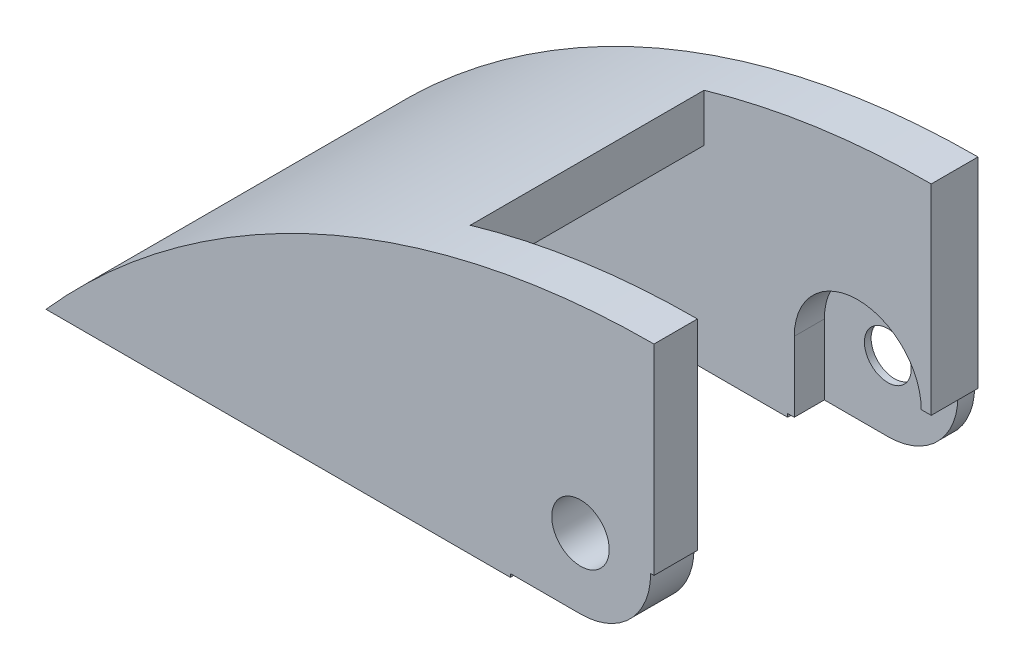
ISO-10303-21;
HEADER;
FILE_DESCRIPTION(('STEP AP214'),'2;1');
FILE_NAME('part.step','',(''),(''),'','','');
FILE_SCHEMA(('AUTOMOTIVE_DESIGN { 1 0 10303 214 1 1 1 1 }'));
ENDSEC;
DATA;
#1=APPLICATION_CONTEXT('core data for automotive mechanical design processes');
#2=APPLICATION_PROTOCOL_DEFINITION('international standard','automotive_design',2000,#1);
#3=PRODUCT_CONTEXT('',#1,'mechanical');
#4=PRODUCT('Part','Part','',(#3));
#5=PRODUCT_RELATED_PRODUCT_CATEGORY('part','',(#4));
#6=PRODUCT_DEFINITION_FORMATION('','',#4);
#7=PRODUCT_DEFINITION_CONTEXT('part definition',#1,'design');
#8=PRODUCT_DEFINITION('design','',#6,#7);
#9=PRODUCT_DEFINITION_SHAPE('','',#8);
#10=(LENGTH_UNIT() NAMED_UNIT(*) SI_UNIT(.MILLI.,.METRE.));
#11=(NAMED_UNIT(*) PLANE_ANGLE_UNIT() SI_UNIT($,.RADIAN.));
#12=(NAMED_UNIT(*) SI_UNIT($,.STERADIAN.) SOLID_ANGLE_UNIT());
#13=UNCERTAINTY_MEASURE_WITH_UNIT(LENGTH_MEASURE(1.E-05),#10,'distance_accuracy_value','');
#14=(GEOMETRIC_REPRESENTATION_CONTEXT(3) GLOBAL_UNCERTAINTY_ASSIGNED_CONTEXT((#13)) GLOBAL_UNIT_ASSIGNED_CONTEXT((#10,
#11,#12)) REPRESENTATION_CONTEXT('',''));
#15=CARTESIAN_POINT('',(0.,0.,0.));
#16=DIRECTION('',(0.,0.,1.));
#17=DIRECTION('',(1.,0.,0.));
#18=AXIS2_PLACEMENT_3D('',#15,#16,#17);
#19=CARTESIAN_POINT('',(0.,0.,-97.));
#20=DIRECTION('',(0.,0.,-1.));
#21=DIRECTION('',(1.,0.,0.));
#22=AXIS2_PLACEMENT_3D('',#19,#20,#21);
#23=PLANE('',#22);
#24=DIRECTION('',(-1.,0.,0.));
#25=VECTOR('',#24,1.);
#26=CARTESIAN_POINT('',(0.,0.,-97.));
#27=LINE('',#26,#25);
#28=CARTESIAN_POINT('',(11.,0.,-97.));
#29=VERTEX_POINT('',#28);
#30=CARTESIAN_POINT('',(10.5,0.,-97.));
#31=VERTEX_POINT('',#30);
#32=EDGE_CURVE('E301',#29,#31,#27,.T.);
#33=ORIENTED_EDGE('',*,*,#32,.T.);
#34=CARTESIAN_POINT('',(0.,0.,-97.));
#35=DIRECTION('',(0.,0.,1.));
#36=DIRECTION('',(1.,0.,0.));
#37=AXIS2_PLACEMENT_3D('',#34,#35,#36);
#38=CIRCLE('',#37,10.5);
#39=CARTESIAN_POINT('',(0.,-10.5,-97.));
#40=VERTEX_POINT('',#39);
#41=EDGE_CURVE('E314',#40,#31,#38,.T.);
#42=ORIENTED_EDGE('',*,*,#41,.F.);
#43=DIRECTION('',(-1.,0.,0.));
#44=VECTOR('',#43,1.);
#45=CARTESIAN_POINT('',(0.,-10.5,-97.));
#46=LINE('',#45,#44);
#47=CARTESIAN_POINT('',(-10.5,-10.5,-97.));
#48=VERTEX_POINT('',#47);
#49=EDGE_CURVE('E318',#40,#48,#46,.T.);
#50=ORIENTED_EDGE('',*,*,#49,.T.);
#51=DIRECTION('',(0.,-1.,0.));
#52=VECTOR('',#51,1.);
#53=CARTESIAN_POINT('',(-10.5,0.,-97.));
#54=LINE('',#53,#52);
#55=CARTESIAN_POINT('',(-10.5,-11.,-97.));
#56=VERTEX_POINT('',#55);
#57=EDGE_CURVE('E322',#48,#56,#54,.T.);
#58=ORIENTED_EDGE('',*,*,#57,.T.);
#59=DIRECTION('',(-1.,0.,0.));
#60=VECTOR('',#59,1.);
#61=CARTESIAN_POINT('',(0.,-11.,-97.));
#62=LINE('',#61,#60);
#63=CARTESIAN_POINT('',(-80.,-11.,-97.));
#64=VERTEX_POINT('',#63);
#65=EDGE_CURVE('E408',#56,#64,#62,.T.);
#66=ORIENTED_EDGE('',*,*,#65,.T.);
#67=CARTESIAN_POINT('',(11.,-91.4878048780488,-97.));
#68=DIRECTION('',(0.,0.,1.));
#69=DIRECTION('',(1.,0.,0.));
#70=AXIS2_PLACEMENT_3D('',#67,#68,#69);
#71=CIRCLE('',#70,121.487804878049);
#72=CARTESIAN_POINT('',(11.,30.,-97.));
#73=VERTEX_POINT('',#72);
#74=EDGE_CURVE('E402',#64,#73,#71,.F.);
#75=ORIENTED_EDGE('',*,*,#74,.T.);
#76=DIRECTION('',(0.,-1.,0.));
#77=VECTOR('',#76,1.);
#78=CARTESIAN_POINT('',(11.,0.,-97.));
#79=LINE('',#78,#77);
#80=EDGE_CURVE('E421',#73,#29,#79,.T.);
#81=ORIENTED_EDGE('',*,*,#80,.T.);
#82=EDGE_LOOP('',(#33,#42,#50,#58,#66,#75,#81));
#83=FACE_BOUND('',#82,.T.);
#84=CARTESIAN_POINT('',(0.,0.,-97.));
#85=DIRECTION('',(0.,0.,1.));
#86=DIRECTION('',(1.,0.,0.));
#87=AXIS2_PLACEMENT_3D('',#84,#85,#86);
#88=CIRCLE('',#87,6.);
#89=CARTESIAN_POINT('',(0.,-6.,-97.));
#90=VERTEX_POINT('',#89);
#91=CARTESIAN_POINT('',(0.,6.,-97.));
#92=VERTEX_POINT('',#91);
#93=EDGE_CURVE('E228',#90,#92,#88,.T.);
#94=ORIENTED_EDGE('',*,*,#93,.T.);
#95=DIRECTION('',(-1.,0.,0.));
#96=VECTOR('',#95,1.);
#97=CARTESIAN_POINT('',(0.,6.,-97.));
#98=LINE('',#97,#96);
#99=CARTESIAN_POINT('',(-25.,6.,-97.));
#100=VERTEX_POINT('',#99);
#101=EDGE_CURVE('E252',#92,#100,#98,.T.);
#102=ORIENTED_EDGE('',*,*,#101,.T.);
#103=DIRECTION('',(0.,-1.,0.));
#104=VECTOR('',#103,1.);
#105=CARTESIAN_POINT('',(-25.,0.,-97.));
#106=LINE('',#105,#104);
#107=CARTESIAN_POINT('',(-25.,-6.,-97.));
#108=VERTEX_POINT('',#107);
#109=EDGE_CURVE('E240',#100,#108,#106,.T.);
#110=ORIENTED_EDGE('',*,*,#109,.T.);
#111=DIRECTION('',(-1.,0.,0.));
#112=VECTOR('',#111,1.);
#113=CARTESIAN_POINT('',(0.,-6.,-97.));
#114=LINE('',#113,#112);
#115=EDGE_CURVE('E247',#90,#108,#114,.T.);
#116=ORIENTED_EDGE('',*,*,#115,.F.);
#117=EDGE_LOOP('',(#94,#102,#110,#116));
#118=FACE_BOUND('',#117,.T.);
#119=ADVANCED_FACE('F49',(#83,#118),#23,.T.);
#120=CARTESIAN_POINT('',(0.,0.,-75.3));
#121=DIRECTION('',(0.,0.,-1.));
#122=DIRECTION('',(1.,0.,0.));
#123=AXIS2_PLACEMENT_3D('',#120,#121,#122);
#124=CYLINDRICAL_SURFACE('',#123,3.5);
#125=CARTESIAN_POINT('',(0.,0.,-94.5));
#126=DIRECTION('',(0.,0.,-1.));
#127=DIRECTION('',(0.,1.,0.));
#128=AXIS2_PLACEMENT_3D('',#125,#126,#127);
#129=CIRCLE('',#128,3.5);
#130=CARTESIAN_POINT('',(0.,3.5,-94.5));
#131=VERTEX_POINT('',#130);
#132=EDGE_CURVE('E53',#131,#131,#129,.T.);
#133=ORIENTED_EDGE('',*,*,#132,.F.);
#134=EDGE_LOOP('',(#133));
#135=FACE_BOUND('',#134,.T.);
#136=CARTESIAN_POINT('',(0.,0.,-95.5));
#137=DIRECTION('',(0.,0.,1.));
#138=DIRECTION('',(1.,0.,0.));
#139=AXIS2_PLACEMENT_3D('',#136,#137,#138);
#140=CIRCLE('',#139,3.5);
#141=CARTESIAN_POINT('',(3.5,0.,-95.5));
#142=VERTEX_POINT('',#141);
#143=EDGE_CURVE('E236',#142,#142,#140,.F.);
#144=ORIENTED_EDGE('',*,*,#143,.T.);
#145=EDGE_LOOP('',(#144));
#146=FACE_BOUND('',#145,.T.);
#147=ADVANCED_FACE('F577',(#135,#146),#124,.F.);
#148=CARTESIAN_POINT('',(12.,-12.,-90.));
#149=DIRECTION('',(0.,0.,-1.));
#150=DIRECTION('',(0.,-1.,0.));
#151=AXIS2_PLACEMENT_3D('',#148,#149,#150);
#152=PLANE('',#151);
#153=DIRECTION('',(-1.,0.,0.));
#154=VECTOR('',#153,1.);
#155=CARTESIAN_POINT('',(12.,0.,-90.));
#156=LINE('',#155,#154);
#157=CARTESIAN_POINT('',(11.,0.,-90.));
#158=VERTEX_POINT('',#157);
#159=CARTESIAN_POINT('',(9.5,0.,-90.));
#160=VERTEX_POINT('',#159);
#161=EDGE_CURVE('E353',#158,#160,#156,.T.);
#162=ORIENTED_EDGE('',*,*,#161,.F.);
#163=DIRECTION('',(0.,-1.,0.));
#164=VECTOR('',#163,1.);
#165=CARTESIAN_POINT('',(11.,-12.,-90.));
#166=LINE('',#165,#164);
#167=CARTESIAN_POINT('',(11.,30.,-90.));
#168=VERTEX_POINT('',#167);
#169=EDGE_CURVE('E434',#168,#158,#166,.T.);
#170=ORIENTED_EDGE('',*,*,#169,.F.);
#171=CARTESIAN_POINT('',(11.0000000000003,-91.4878048780494,-90.));
#172=DIRECTION('',(0.,0.,1.));
#173=DIRECTION('',(0.,-1.,0.));
#174=AXIS2_PLACEMENT_3D('',#171,#172,#173);
#175=CIRCLE('',#174,121.487804878049);
#176=CARTESIAN_POINT('',(-23.,25.1453239237065,-90.));
#177=VERTEX_POINT('',#176);
#178=EDGE_CURVE('E391',#177,#168,#175,.F.);
#179=ORIENTED_EDGE('',*,*,#178,.F.);
#180=DIRECTION('',(0.,1.,0.));
#181=VECTOR('',#180,1.);
#182=CARTESIAN_POINT('',(-23.,15.5,-90.));
#183=LINE('',#182,#181);
#184=CARTESIAN_POINT('',(-23.,18.,-90.));
#185=VERTEX_POINT('',#184);
#186=EDGE_CURVE('E443',#185,#177,#183,.T.);
#187=ORIENTED_EDGE('',*,*,#186,.F.);
#188=DIRECTION('',(1.,0.,0.));
#189=VECTOR('',#188,1.);
#190=CARTESIAN_POINT('',(0.,18.,-90.));
#191=LINE('',#190,#189);
#192=CARTESIAN_POINT('',(-34.2965836217796,18.,-90.));
#193=VERTEX_POINT('',#192);
#194=EDGE_CURVE('E407',#193,#185,#191,.T.);
#195=ORIENTED_EDGE('',*,*,#194,.F.);
#196=CARTESIAN_POINT('',(11.,-91.4878048780488,-90.));
#197=DIRECTION('',(0.,0.,1.));
#198=DIRECTION('',(0.,-1.,0.));
#199=AXIS2_PLACEMENT_3D('',#196,#197,#198);
#200=CIRCLE('',#199,118.487804878049);
#201=CARTESIAN_POINT('',(-75.954431576152,-11.,-90.));
#202=VERTEX_POINT('',#201);
#203=EDGE_CURVE('E384',#193,#202,#200,.T.);
#204=ORIENTED_EDGE('',*,*,#203,.T.);
#205=DIRECTION('',(-1.,0.,0.));
#206=VECTOR('',#205,1.);
#207=CARTESIAN_POINT('',(0.,-11.,-90.));
#208=LINE('',#207,#206);
#209=CARTESIAN_POINT('',(-10.5,-11.,-90.));
#210=VERTEX_POINT('',#209);
#211=EDGE_CURVE('E403',#210,#202,#208,.T.);
#212=ORIENTED_EDGE('',*,*,#211,.F.);
#213=DIRECTION('',(0.,-1.,0.));
#214=VECTOR('',#213,1.);
#215=CARTESIAN_POINT('',(-10.5,-12.,-90.));
#216=LINE('',#215,#214);
#217=CARTESIAN_POINT('',(-10.5,-10.5,-90.));
#218=VERTEX_POINT('',#217);
#219=EDGE_CURVE('E349',#218,#210,#216,.T.);
#220=ORIENTED_EDGE('',*,*,#219,.F.);
#221=DIRECTION('',(-1.,0.,0.));
#222=VECTOR('',#221,1.);
#223=CARTESIAN_POINT('',(12.,-10.5,-90.));
#224=LINE('',#223,#222);
#225=CARTESIAN_POINT('',(-9.5,-10.5,-90.));
#226=VERTEX_POINT('',#225);
#227=EDGE_CURVE('E332',#226,#218,#224,.T.);
#228=ORIENTED_EDGE('',*,*,#227,.F.);
#229=DIRECTION('',(0.,1.,0.));
#230=VECTOR('',#229,1.);
#231=CARTESIAN_POINT('',(-9.5,-12.,-90.));
#232=LINE('',#231,#230);
#233=CARTESIAN_POINT('',(-9.5,0.,-90.));
#234=VERTEX_POINT('',#233);
#235=EDGE_CURVE('E287',#226,#234,#232,.T.);
#236=ORIENTED_EDGE('',*,*,#235,.T.);
#237=CARTESIAN_POINT('',(0.,0.,-90.));
#238=DIRECTION('',(0.,0.,-1.));
#239=DIRECTION('',(0.,1.,0.));
#240=AXIS2_PLACEMENT_3D('',#237,#238,#239);
#241=CIRCLE('',#240,9.5);
#242=EDGE_CURVE('E448',#234,#160,#241,.T.);
#243=ORIENTED_EDGE('',*,*,#242,.T.);
#244=EDGE_LOOP('',(#162,#170,#179,#187,#195,#204,#212,#220,#228,#236,#243));
#245=FACE_BOUND('',#244,.T.);
#246=ADVANCED_FACE('F529',(#245),#152,.F.);
#247=CARTESIAN_POINT('',(0.,0.,-94.5));
#248=DIRECTION('',(0.,0.,1.));
#249=DIRECTION('',(0.,1.,0.));
#250=AXIS2_PLACEMENT_3D('',#247,#248,#249);
#251=CYLINDRICAL_SURFACE('',#250,9.5);
#252=DIRECTION('',(0.,0.,1.));
#253=VECTOR('',#252,1.);
#254=CARTESIAN_POINT('',(9.5,0.,-94.5));
#255=LINE('',#254,#253);
#256=CARTESIAN_POINT('',(9.5,0.,-94.5));
#257=VERTEX_POINT('',#256);
#258=EDGE_CURVE('E284',#257,#160,#255,.T.);
#259=ORIENTED_EDGE('',*,*,#258,.T.);
#260=ORIENTED_EDGE('',*,*,#242,.F.);
#261=DIRECTION('',(0.,0.,1.));
#262=VECTOR('',#261,1.);
#263=CARTESIAN_POINT('',(-9.5,0.,-94.5));
#264=LINE('',#263,#262);
#265=CARTESIAN_POINT('',(-9.5,0.,-94.5));
#266=VERTEX_POINT('',#265);
#267=EDGE_CURVE('E281',#266,#234,#264,.T.);
#268=ORIENTED_EDGE('',*,*,#267,.F.);
#269=CARTESIAN_POINT('',(0.,0.,-94.5));
#270=DIRECTION('',(0.,0.,-1.));
#271=DIRECTION('',(0.,1.,0.));
#272=AXIS2_PLACEMENT_3D('',#269,#270,#271);
#273=CIRCLE('',#272,9.5);
#274=EDGE_CURVE('E447',#266,#257,#273,.T.);
#275=ORIENTED_EDGE('',*,*,#274,.T.);
#276=EDGE_LOOP('',(#259,#260,#268,#275));
#277=FACE_BOUND('',#276,.T.);
#278=ADVANCED_FACE('F586',(#277),#251,.F.);
#279=CARTESIAN_POINT('',(0.,-10.5,-48.5));
#280=DIRECTION('',(0.,1.,0.));
#281=DIRECTION('',(0.,0.,-1.));
#282=AXIS2_PLACEMENT_3D('',#279,#280,#281);
#283=PLANE('',#282);
#284=DIRECTION('',(0.,0.,1.));
#285=VECTOR('',#284,1.);
#286=CARTESIAN_POINT('',(-9.5,-10.5,-94.5));
#287=LINE('',#286,#285);
#288=CARTESIAN_POINT('',(-9.5,-10.5,-94.5));
#289=VERTEX_POINT('',#288);
#290=EDGE_CURVE('E278',#289,#226,#287,.T.);
#291=ORIENTED_EDGE('',*,*,#290,.T.);
#292=ORIENTED_EDGE('',*,*,#227,.T.);
#293=DIRECTION('',(0.,0.,-1.));
#294=VECTOR('',#293,1.);
#295=CARTESIAN_POINT('',(-10.5,-10.5,-48.5));
#296=LINE('',#295,#294);
#297=EDGE_CURVE('E342',#218,#48,#296,.T.);
#298=ORIENTED_EDGE('',*,*,#297,.T.);
#299=ORIENTED_EDGE('',*,*,#49,.F.);
#300=DIRECTION('',(0.,0.,-1.));
#301=VECTOR('',#300,1.);
#302=CARTESIAN_POINT('',(0.,-10.5,-48.5));
#303=LINE('',#302,#301);
#304=CARTESIAN_POINT('',(0.,-10.5,-94.5));
#305=VERTEX_POINT('',#304);
#306=EDGE_CURVE('E313',#305,#40,#303,.T.);
#307=ORIENTED_EDGE('',*,*,#306,.F.);
#308=DIRECTION('',(-1.,0.,0.));
#309=VECTOR('',#308,1.);
#310=CARTESIAN_POINT('',(0.,-10.5,-94.5));
#311=LINE('',#310,#309);
#312=EDGE_CURVE('E266',#305,#289,#311,.T.);
#313=ORIENTED_EDGE('',*,*,#312,.T.);
#314=EDGE_LOOP('',(#291,#292,#298,#299,#307,#313));
#315=FACE_BOUND('',#314,.T.);
#316=ADVANCED_FACE('F543',(#315),#283,.F.);
#317=CARTESIAN_POINT('',(11.,0.,-48.5));
#318=DIRECTION('',(-1.,0.,0.));
#319=DIRECTION('',(0.,0.,-1.));
#320=AXIS2_PLACEMENT_3D('',#317,#318,#319);
#321=PLANE('',#320);
#322=DIRECTION('',(0.,1.,0.));
#323=VECTOR('',#322,1.);
#324=CARTESIAN_POINT('',(11.,0.,-55.));
#325=LINE('',#324,#323);
#326=CARTESIAN_POINT('',(11.,0.,-55.));
#327=VERTEX_POINT('',#326);
#328=CARTESIAN_POINT('',(11.,30.,-55.));
#329=VERTEX_POINT('',#328);
#330=EDGE_CURVE('E357',#327,#329,#325,.T.);
#331=ORIENTED_EDGE('',*,*,#330,.T.);
#332=DIRECTION('',(0.,0.,-1.));
#333=VECTOR('',#332,1.);
#334=CARTESIAN_POINT('',(11.,30.,-48.5));
#335=LINE('',#334,#333);
#336=CARTESIAN_POINT('',(11.,30.,-48.5));
#337=VERTEX_POINT('',#336);
#338=EDGE_CURVE('E430',#337,#329,#335,.T.);
#339=ORIENTED_EDGE('',*,*,#338,.F.);
#340=DIRECTION('',(0.,-1.,0.));
#341=VECTOR('',#340,1.);
#342=CARTESIAN_POINT('',(11.,0.,-48.5));
#343=LINE('',#342,#341);
#344=CARTESIAN_POINT('',(11.,0.,-48.5));
#345=VERTEX_POINT('',#344);
#346=EDGE_CURVE('E422',#337,#345,#343,.T.);
#347=ORIENTED_EDGE('',*,*,#346,.T.);
#348=DIRECTION('',(0.,0.,-1.));
#349=VECTOR('',#348,1.);
#350=CARTESIAN_POINT('',(11.,0.,-48.5));
#351=LINE('',#350,#349);
#352=EDGE_CURVE('E436',#345,#327,#351,.T.);
#353=ORIENTED_EDGE('',*,*,#352,.T.);
#354=EDGE_LOOP('',(#331,#339,#347,#353));
#355=FACE_BOUND('',#354,.T.);
#356=ADVANCED_FACE('F497',(#355),#321,.F.);
#357=CARTESIAN_POINT('',(12.,18.,-90.));
#358=DIRECTION('',(0.,1.,0.));
#359=DIRECTION('',(0.,0.,-1.));
#360=AXIS2_PLACEMENT_3D('',#357,#358,#359);
#361=PLANE('',#360);
#362=DIRECTION('',(0.,0.,-1.));
#363=VECTOR('',#362,1.);
#364=CARTESIAN_POINT('',(-34.2965836217796,18.,-55.5));
#365=LINE('',#364,#363);
#366=CARTESIAN_POINT('',(-34.2965836217796,18.,-55.));
#367=VERTEX_POINT('',#366);
#368=EDGE_CURVE('E381',#367,#193,#365,.T.);
#369=ORIENTED_EDGE('',*,*,#368,.T.);
#370=ORIENTED_EDGE('',*,*,#194,.T.);
#371=DIRECTION('',(0.,0.,-1.));
#372=VECTOR('',#371,1.);
#373=CARTESIAN_POINT('',(-23.,18.,-90.));
#374=LINE('',#373,#372);
#375=CARTESIAN_POINT('',(-23.,18.,-55.));
#376=VERTEX_POINT('',#375);
#377=EDGE_CURVE('E452',#376,#185,#374,.T.);
#378=ORIENTED_EDGE('',*,*,#377,.F.);
#379=DIRECTION('',(-1.,0.,0.));
#380=VECTOR('',#379,1.);
#381=CARTESIAN_POINT('',(0.,18.,-55.));
#382=LINE('',#381,#380);
#383=EDGE_CURVE('E367',#376,#367,#382,.T.);
#384=ORIENTED_EDGE('',*,*,#383,.T.);
#385=EDGE_LOOP('',(#369,#370,#378,#384));
#386=FACE_BOUND('',#385,.T.);
#387=ADVANCED_FACE('F485',(#386),#361,.F.);
#388=CARTESIAN_POINT('',(0.,0.,-48.5));
#389=DIRECTION('',(0.,0.,1.));
#390=DIRECTION('',(-1.,0.,0.));
#391=AXIS2_PLACEMENT_3D('',#388,#389,#390);
#392=PLANE('',#391);
#393=CARTESIAN_POINT('',(0.,0.,-48.5));
#394=DIRECTION('',(0.,0.,1.));
#395=DIRECTION('',(1.,0.,0.));
#396=AXIS2_PLACEMENT_3D('',#393,#394,#395);
#397=CIRCLE('',#396,4.3);
#398=CARTESIAN_POINT('',(4.3,0.,-48.5));
#399=VERTEX_POINT('',#398);
#400=EDGE_CURVE('E291',#399,#399,#397,.T.);
#401=ORIENTED_EDGE('',*,*,#400,.F.);
#402=EDGE_LOOP('',(#401));
#403=FACE_BOUND('',#402,.T.);
#404=DIRECTION('',(-1.,0.,0.));
#405=VECTOR('',#404,1.);
#406=CARTESIAN_POINT('',(0.,0.,-48.5));
#407=LINE('',#406,#405);
#408=CARTESIAN_POINT('',(10.5,0.,-48.5));
#409=VERTEX_POINT('',#408);
#410=EDGE_CURVE('E309',#345,#409,#407,.T.);
#411=ORIENTED_EDGE('',*,*,#410,.F.);
#412=ORIENTED_EDGE('',*,*,#346,.F.);
#413=CARTESIAN_POINT('',(11.,-91.4878048780488,-48.5));
#414=DIRECTION('',(0.,0.,1.));
#415=DIRECTION('',(1.,0.,0.));
#416=AXIS2_PLACEMENT_3D('',#413,#414,#415);
#417=CIRCLE('',#416,121.487804878049);
#418=CARTESIAN_POINT('',(-80.,-11.,-48.5));
#419=VERTEX_POINT('',#418);
#420=EDGE_CURVE('E395',#419,#337,#417,.F.);
#421=ORIENTED_EDGE('',*,*,#420,.F.);
#422=DIRECTION('',(-1.,0.,0.));
#423=VECTOR('',#422,1.);
#424=CARTESIAN_POINT('',(0.,-11.,-48.5));
#425=LINE('',#424,#423);
#426=CARTESIAN_POINT('',(-10.5,-11.,-48.5));
#427=VERTEX_POINT('',#426);
#428=EDGE_CURVE('E398',#427,#419,#425,.T.);
#429=ORIENTED_EDGE('',*,*,#428,.F.);
#430=DIRECTION('',(0.,-1.,0.));
#431=VECTOR('',#430,1.);
#432=CARTESIAN_POINT('',(-10.5,0.,-48.5));
#433=LINE('',#432,#431);
#434=CARTESIAN_POINT('',(-10.5,-10.5,-48.5));
#435=VERTEX_POINT('',#434);
#436=EDGE_CURVE('E305',#435,#427,#433,.T.);
#437=ORIENTED_EDGE('',*,*,#436,.F.);
#438=DIRECTION('',(-1.,0.,0.));
#439=VECTOR('',#438,1.);
#440=CARTESIAN_POINT('',(0.,-10.5,-48.5));
#441=LINE('',#440,#439);
#442=CARTESIAN_POINT('',(0.,-10.5,-48.5));
#443=VERTEX_POINT('',#442);
#444=EDGE_CURVE('E300',#443,#435,#441,.T.);
#445=ORIENTED_EDGE('',*,*,#444,.F.);
#446=CARTESIAN_POINT('',(0.,0.,-48.5));
#447=DIRECTION('',(0.,0.,1.));
#448=DIRECTION('',(1.,0.,0.));
#449=AXIS2_PLACEMENT_3D('',#446,#447,#448);
#450=CIRCLE('',#449,10.5);
#451=EDGE_CURVE('E296',#443,#409,#450,.T.);
#452=ORIENTED_EDGE('',*,*,#451,.T.);
#453=EDGE_LOOP('',(#411,#412,#421,#429,#437,#445,#452));
#454=FACE_BOUND('',#453,.T.);
#455=ADVANCED_FACE('F482',(#403,#454),#392,.T.);
#456=CARTESIAN_POINT('',(0.,0.,-94.5));
#457=DIRECTION('',(0.,0.,1.));
#458=DIRECTION('',(0.,1.,0.));
#459=AXIS2_PLACEMENT_3D('',#456,#457,#458);
#460=PLANE('',#459);
#461=ORIENTED_EDGE('',*,*,#132,.T.);
#462=EDGE_LOOP('',(#461));
#463=FACE_BOUND('',#462,.T.);
#464=ORIENTED_EDGE('',*,*,#274,.F.);
#465=DIRECTION('',(0.,-1.,0.));
#466=VECTOR('',#465,1.);
#467=CARTESIAN_POINT('',(-9.5,0.,-94.5));
#468=LINE('',#467,#466);
#469=EDGE_CURVE('E275',#266,#289,#468,.T.);
#470=ORIENTED_EDGE('',*,*,#469,.T.);
#471=ORIENTED_EDGE('',*,*,#312,.F.);
#472=CARTESIAN_POINT('',(0.,0.,-94.5));
#473=DIRECTION('',(0.,0.,1.));
#474=DIRECTION('',(1.,0.,0.));
#475=AXIS2_PLACEMENT_3D('',#472,#473,#474);
#476=CIRCLE('',#475,10.5);
#477=CARTESIAN_POINT('',(10.5,0.,-94.5));
#478=VERTEX_POINT('',#477);
#479=EDGE_CURVE('E75',#305,#478,#476,.T.);
#480=ORIENTED_EDGE('',*,*,#479,.T.);
#481=DIRECTION('',(-1.,0.,0.));
#482=VECTOR('',#481,1.);
#483=CARTESIAN_POINT('',(0.,0.,-94.5));
#484=LINE('',#483,#482);
#485=EDGE_CURVE('E272',#478,#257,#484,.T.);
#486=ORIENTED_EDGE('',*,*,#485,.T.);
#487=EDGE_LOOP('',(#464,#470,#471,#480,#486));
#488=FACE_BOUND('',#487,.T.);
#489=ADVANCED_FACE('F51',(#463,#488),#460,.T.);
#490=CARTESIAN_POINT('',(-23.,15.5,-56.));
#491=DIRECTION('',(-1.,0.,0.));
#492=DIRECTION('',(0.,0.,-1.));
#493=AXIS2_PLACEMENT_3D('',#490,#491,#492);
#494=PLANE('',#493);
#495=DIRECTION('',(0.,0.,-1.));
#496=VECTOR('',#495,1.);
#497=CARTESIAN_POINT('',(-23.,25.1453239237065,-48.5));
#498=LINE('',#497,#496);
#499=CARTESIAN_POINT('',(-23.,25.1453239237065,-55.));
#500=VERTEX_POINT('',#499);
#501=EDGE_CURVE('E388',#500,#177,#498,.T.);
#502=ORIENTED_EDGE('',*,*,#501,.F.);
#503=DIRECTION('',(0.,-1.,0.));
#504=VECTOR('',#503,1.);
#505=CARTESIAN_POINT('',(-23.,0.,-55.));
#506=LINE('',#505,#504);
#507=EDGE_CURVE('E364',#500,#376,#506,.T.);
#508=ORIENTED_EDGE('',*,*,#507,.T.);
#509=ORIENTED_EDGE('',*,*,#377,.T.);
#510=ORIENTED_EDGE('',*,*,#186,.T.);
#511=EDGE_LOOP('',(#502,#508,#509,#510));
#512=FACE_BOUND('',#511,.T.);
#513=ADVANCED_FACE('F522',(#512),#494,.F.);
#514=EDGE_CURVE('E435',#168,#73,#335,.T.);
#515=ORIENTED_EDGE('',*,*,#514,.F.);
#516=ORIENTED_EDGE('',*,*,#169,.T.);
#517=EDGE_CURVE('E426',#158,#29,#351,.T.);
#518=ORIENTED_EDGE('',*,*,#517,.T.);
#519=ORIENTED_EDGE('',*,*,#80,.F.);
#520=EDGE_LOOP('',(#515,#516,#518,#519));
#521=FACE_BOUND('',#520,.T.);
#522=ADVANCED_FACE('F531',(#521),#321,.F.);
#523=CARTESIAN_POINT('',(11.,-91.4878048780488,-90.));
#524=DIRECTION('',(0.,0.,-1.));
#525=DIRECTION('',(1.,0.,0.));
#526=AXIS2_PLACEMENT_3D('',#523,#524,#525);
#527=CYLINDRICAL_SURFACE('',#526,121.487804878049);
#528=ORIENTED_EDGE('',*,*,#501,.T.);
#529=ORIENTED_EDGE('',*,*,#178,.T.);
#530=ORIENTED_EDGE('',*,*,#514,.T.);
#531=ORIENTED_EDGE('',*,*,#74,.F.);
#532=DIRECTION('',(0.,0.,-1.));
#533=VECTOR('',#532,1.);
#534=CARTESIAN_POINT('',(-80.,-11.,-90.));
#535=LINE('',#534,#533);
#536=EDGE_CURVE('E412',#419,#64,#535,.T.);
#537=ORIENTED_EDGE('',*,*,#536,.F.);
#538=ORIENTED_EDGE('',*,*,#420,.T.);
#539=ORIENTED_EDGE('',*,*,#338,.T.);
#540=CARTESIAN_POINT('',(11.0000000000003,-91.4878048780494,-55.));
#541=DIRECTION('',(0.,0.,1.));
#542=DIRECTION('',(1.,0.,0.));
#543=AXIS2_PLACEMENT_3D('',#540,#541,#542);
#544=CIRCLE('',#543,121.487804878049);
#545=EDGE_CURVE('E361',#329,#500,#544,.T.);
#546=ORIENTED_EDGE('',*,*,#545,.T.);
#547=EDGE_LOOP('',(#528,#529,#530,#531,#537,#538,#539,#546));
#548=FACE_BOUND('',#547,.T.);
#549=ADVANCED_FACE('F499',(#548),#527,.T.);
#550=CARTESIAN_POINT('',(0.,-11.,-90.));
#551=DIRECTION('',(0.,1.,0.));
#552=DIRECTION('',(-1.,0.,0.));
#553=AXIS2_PLACEMENT_3D('',#550,#551,#552);
#554=PLANE('',#553);
#555=ORIENTED_EDGE('',*,*,#428,.T.);
#556=ORIENTED_EDGE('',*,*,#536,.T.);
#557=ORIENTED_EDGE('',*,*,#65,.F.);
#558=DIRECTION('',(0.,0.,-1.));
#559=VECTOR('',#558,1.);
#560=CARTESIAN_POINT('',(-10.5,-11.,-48.5));
#561=LINE('',#560,#559);
#562=EDGE_CURVE('E338',#210,#56,#561,.T.);
#563=ORIENTED_EDGE('',*,*,#562,.F.);
#564=ORIENTED_EDGE('',*,*,#211,.T.);
#565=DIRECTION('',(0.,0.,-1.));
#566=VECTOR('',#565,1.);
#567=CARTESIAN_POINT('',(-75.954431576152,-11.,-55.5));
#568=LINE('',#567,#566);
#569=CARTESIAN_POINT('',(-75.954431576152,-11.,-55.));
#570=VERTEX_POINT('',#569);
#571=EDGE_CURVE('E378',#570,#202,#568,.T.);
#572=ORIENTED_EDGE('',*,*,#571,.F.);
#573=DIRECTION('',(1.,0.,0.));
#574=VECTOR('',#573,1.);
#575=CARTESIAN_POINT('',(0.,-11.,-55.));
#576=LINE('',#575,#574);
#577=CARTESIAN_POINT('',(-10.5,-11.,-55.));
#578=VERTEX_POINT('',#577);
#579=EDGE_CURVE('E374',#570,#578,#576,.T.);
#580=ORIENTED_EDGE('',*,*,#579,.T.);
#581=EDGE_CURVE('E334',#427,#578,#561,.T.);
#582=ORIENTED_EDGE('',*,*,#581,.F.);
#583=EDGE_LOOP('',(#555,#556,#557,#563,#564,#572,#580,#582));
#584=FACE_BOUND('',#583,.T.);
#585=ADVANCED_FACE('F505',(#584),#554,.F.);
#586=CARTESIAN_POINT('',(11.,-91.4878048780488,-55.5));
#587=DIRECTION('',(0.,0.,-1.));
#588=DIRECTION('',(1.,0.,0.));
#589=AXIS2_PLACEMENT_3D('',#586,#587,#588);
#590=CYLINDRICAL_SURFACE('',#589,118.487804878049);
#591=ORIENTED_EDGE('',*,*,#368,.F.);
#592=CARTESIAN_POINT('',(11.,-91.4878048780488,-55.));
#593=DIRECTION('',(0.,0.,1.));
#594=DIRECTION('',(1.,0.,0.));
#595=AXIS2_PLACEMENT_3D('',#592,#593,#594);
#596=CIRCLE('',#595,118.487804878049);
#597=EDGE_CURVE('E371',#367,#570,#596,.T.);
#598=ORIENTED_EDGE('',*,*,#597,.T.);
#599=ORIENTED_EDGE('',*,*,#571,.T.);
#600=ORIENTED_EDGE('',*,*,#203,.F.);
#601=EDGE_LOOP('',(#591,#598,#599,#600));
#602=FACE_BOUND('',#601,.T.);
#603=ADVANCED_FACE('F567',(#602),#590,.F.);
#604=CARTESIAN_POINT('',(0.,0.,-55.));
#605=DIRECTION('',(0.,0.,-1.));
#606=DIRECTION('',(1.,0.,0.));
#607=AXIS2_PLACEMENT_3D('',#604,#605,#606);
#608=PLANE('',#607);
#609=CARTESIAN_POINT('',(0.,0.,-55.));
#610=DIRECTION('',(0.,0.,1.));
#611=DIRECTION('',(1.,0.,0.));
#612=AXIS2_PLACEMENT_3D('',#609,#610,#611);
#613=CIRCLE('',#612,4.3);
#614=CARTESIAN_POINT('',(4.3,0.,-55.));
#615=VERTEX_POINT('',#614);
#616=EDGE_CURVE('E295',#615,#615,#613,.T.);
#617=ORIENTED_EDGE('',*,*,#616,.T.);
#618=EDGE_LOOP('',(#617));
#619=FACE_BOUND('',#618,.T.);
#620=DIRECTION('',(-1.,0.,0.));
#621=VECTOR('',#620,1.);
#622=CARTESIAN_POINT('',(0.,0.,-55.));
#623=LINE('',#622,#621);
#624=CARTESIAN_POINT('',(10.5,0.,-55.));
#625=VERTEX_POINT('',#624);
#626=EDGE_CURVE('E11',#327,#625,#623,.T.);
#627=ORIENTED_EDGE('',*,*,#626,.T.);
#628=CARTESIAN_POINT('',(0.,0.,-55.));
#629=DIRECTION('',(0.,0.,1.));
#630=DIRECTION('',(1.,0.,0.));
#631=AXIS2_PLACEMENT_3D('',#628,#629,#630);
#632=CIRCLE('',#631,10.5);
#633=CARTESIAN_POINT('',(0.,-10.5,-55.));
#634=VERTEX_POINT('',#633);
#635=EDGE_CURVE('E59',#634,#625,#632,.T.);
#636=ORIENTED_EDGE('',*,*,#635,.F.);
#637=DIRECTION('',(-1.,0.,0.));
#638=VECTOR('',#637,1.);
#639=CARTESIAN_POINT('',(0.,-10.5,-55.));
#640=LINE('',#639,#638);
#641=CARTESIAN_POINT('',(-10.5,-10.5,-55.));
#642=VERTEX_POINT('',#641);
#643=EDGE_CURVE('E458',#634,#642,#640,.T.);
#644=ORIENTED_EDGE('',*,*,#643,.T.);
#645=DIRECTION('',(0.,-1.,0.));
#646=VECTOR('',#645,1.);
#647=CARTESIAN_POINT('',(-10.5,0.,-55.));
#648=LINE('',#647,#646);
#649=EDGE_CURVE('E462',#642,#578,#648,.T.);
#650=ORIENTED_EDGE('',*,*,#649,.T.);
#651=ORIENTED_EDGE('',*,*,#579,.F.);
#652=ORIENTED_EDGE('',*,*,#597,.F.);
#653=ORIENTED_EDGE('',*,*,#383,.F.);
#654=ORIENTED_EDGE('',*,*,#507,.F.);
#655=ORIENTED_EDGE('',*,*,#545,.F.);
#656=ORIENTED_EDGE('',*,*,#330,.F.);
#657=EDGE_LOOP('',(#627,#636,#644,#650,#651,#652,#653,#654,#655,#656));
#658=FACE_BOUND('',#657,.T.);
#659=ADVANCED_FACE('F471',(#619,#658),#608,.T.);
#660=CARTESIAN_POINT('',(0.,0.,-48.5));
#661=DIRECTION('',(0.,1.,0.));
#662=DIRECTION('',(0.,0.,-1.));
#663=AXIS2_PLACEMENT_3D('',#660,#661,#662);
#664=PLANE('',#663);
#665=ORIENTED_EDGE('',*,*,#626,.F.);
#666=ORIENTED_EDGE('',*,*,#352,.F.);
#667=ORIENTED_EDGE('',*,*,#410,.T.);
#668=DIRECTION('',(0.,0.,-1.));
#669=VECTOR('',#668,1.);
#670=CARTESIAN_POINT('',(10.5,0.,-48.5));
#671=LINE('',#670,#669);
#672=EDGE_CURVE('E329',#409,#625,#671,.T.);
#673=ORIENTED_EDGE('',*,*,#672,.T.);
#674=EDGE_LOOP('',(#665,#666,#667,#673));
#675=FACE_BOUND('',#674,.T.);
#676=ADVANCED_FACE('F494',(#675),#664,.F.);
#677=ORIENTED_EDGE('',*,*,#643,.F.);
#678=EDGE_CURVE('E343',#443,#634,#303,.T.);
#679=ORIENTED_EDGE('',*,*,#678,.F.);
#680=ORIENTED_EDGE('',*,*,#444,.T.);
#681=EDGE_CURVE('E339',#435,#642,#296,.T.);
#682=ORIENTED_EDGE('',*,*,#681,.T.);
#683=EDGE_LOOP('',(#677,#679,#680,#682));
#684=FACE_BOUND('',#683,.T.);
#685=ADVANCED_FACE('F514',(#684),#283,.F.);
#686=CARTESIAN_POINT('',(-10.5,0.,-48.5));
#687=DIRECTION('',(-1.,0.,0.));
#688=DIRECTION('',(0.,0.,-1.));
#689=AXIS2_PLACEMENT_3D('',#686,#687,#688);
#690=PLANE('',#689);
#691=ORIENTED_EDGE('',*,*,#649,.F.);
#692=ORIENTED_EDGE('',*,*,#681,.F.);
#693=ORIENTED_EDGE('',*,*,#436,.T.);
#694=ORIENTED_EDGE('',*,*,#581,.T.);
#695=EDGE_LOOP('',(#691,#692,#693,#694));
#696=FACE_BOUND('',#695,.T.);
#697=ADVANCED_FACE('F511',(#696),#690,.F.);
#698=CARTESIAN_POINT('',(0.,0.,-48.5));
#699=DIRECTION('',(0.,0.,-1.));
#700=DIRECTION('',(1.,0.,0.));
#701=AXIS2_PLACEMENT_3D('',#698,#699,#700);
#702=CYLINDRICAL_SURFACE('',#701,10.5);
#703=ORIENTED_EDGE('',*,*,#678,.T.);
#704=ORIENTED_EDGE('',*,*,#635,.T.);
#705=ORIENTED_EDGE('',*,*,#672,.F.);
#706=ORIENTED_EDGE('',*,*,#451,.F.);
#707=EDGE_LOOP('',(#703,#704,#705,#706));
#708=FACE_BOUND('',#707,.T.);
#709=ADVANCED_FACE('F517',(#708),#702,.T.);
#710=ORIENTED_EDGE('',*,*,#479,.F.);
#711=ORIENTED_EDGE('',*,*,#306,.T.);
#712=ORIENTED_EDGE('',*,*,#41,.T.);
#713=EDGE_CURVE('E333',#478,#31,#671,.T.);
#714=ORIENTED_EDGE('',*,*,#713,.F.);
#715=EDGE_LOOP('',(#710,#711,#712,#714));
#716=FACE_BOUND('',#715,.T.);
#717=ADVANCED_FACE('F540',(#716),#702,.T.);
#718=ORIENTED_EDGE('',*,*,#517,.F.);
#719=ORIENTED_EDGE('',*,*,#161,.T.);
#720=ORIENTED_EDGE('',*,*,#258,.F.);
#721=ORIENTED_EDGE('',*,*,#485,.F.);
#722=ORIENTED_EDGE('',*,*,#713,.T.);
#723=ORIENTED_EDGE('',*,*,#32,.F.);
#724=EDGE_LOOP('',(#718,#719,#720,#721,#722,#723));
#725=FACE_BOUND('',#724,.T.);
#726=ADVANCED_FACE('F549',(#725),#664,.F.);
#727=ORIENTED_EDGE('',*,*,#297,.F.);
#728=ORIENTED_EDGE('',*,*,#219,.T.);
#729=ORIENTED_EDGE('',*,*,#562,.T.);
#730=ORIENTED_EDGE('',*,*,#57,.F.);
#731=EDGE_LOOP('',(#727,#728,#729,#730));
#732=FACE_BOUND('',#731,.T.);
#733=ADVANCED_FACE('F478',(#732),#690,.F.);
#734=CARTESIAN_POINT('',(0.,0.,-48.5));
#735=DIRECTION('',(0.,0.,-1.));
#736=DIRECTION('',(1.,0.,0.));
#737=AXIS2_PLACEMENT_3D('',#734,#735,#736);
#738=CYLINDRICAL_SURFACE('',#737,4.3);
#739=CARTESIAN_POINT('',(4.3,0.,-55.));
#740=CARTESIAN_POINT('',(4.3,0.,-54.9322916666667));
#741=CARTESIAN_POINT('',(4.3,0.,-54.8645833333333));
#742=CARTESIAN_POINT('',(4.3,0.,-54.7291666666667));
#743=CARTESIAN_POINT('',(4.3,0.,-54.6614583333333));
#744=CARTESIAN_POINT('',(4.3,0.,-54.5260416666667));
#745=CARTESIAN_POINT('',(4.3,0.,-54.4583333333333));
#746=CARTESIAN_POINT('',(4.3,0.,-54.3229166666667));
#747=CARTESIAN_POINT('',(4.3,0.,-54.2552083333333));
#748=CARTESIAN_POINT('',(4.3,0.,-54.1197916666667));
#749=CARTESIAN_POINT('',(4.3,0.,-54.0520833333333));
#750=CARTESIAN_POINT('',(4.3,0.,-53.9166666666667));
#751=CARTESIAN_POINT('',(4.3,0.,-53.8489583333333));
#752=CARTESIAN_POINT('',(4.3,0.,-53.7135416666667));
#753=CARTESIAN_POINT('',(4.3,0.,-53.6458333333333));
#754=CARTESIAN_POINT('',(4.3,0.,-53.5104166666667));
#755=CARTESIAN_POINT('',(4.3,0.,-53.4427083333333));
#756=CARTESIAN_POINT('',(4.3,0.,-53.3072916666667));
#757=CARTESIAN_POINT('',(4.3,0.,-53.2395833333333));
#758=CARTESIAN_POINT('',(4.3,0.,-53.1041666666667));
#759=CARTESIAN_POINT('',(4.3,0.,-53.0364583333333));
#760=CARTESIAN_POINT('',(4.3,0.,-52.9010416666667));
#761=CARTESIAN_POINT('',(4.3,0.,-52.8333333333333));
#762=CARTESIAN_POINT('',(4.3,0.,-52.6979166666667));
#763=CARTESIAN_POINT('',(4.3,0.,-52.6302083333333));
#764=CARTESIAN_POINT('',(4.3,0.,-52.4947916666667));
#765=CARTESIAN_POINT('',(4.3,0.,-52.4270833333333));
#766=CARTESIAN_POINT('',(4.3,0.,-52.2916666666667));
#767=CARTESIAN_POINT('',(4.3,0.,-52.2239583333333));
#768=CARTESIAN_POINT('',(4.3,0.,-52.0885416666667));
#769=CARTESIAN_POINT('',(4.3,0.,-52.0208333333333));
#770=CARTESIAN_POINT('',(4.3,0.,-51.8854166666667));
#771=CARTESIAN_POINT('',(4.3,0.,-51.8177083333333));
#772=CARTESIAN_POINT('',(4.3,0.,-51.6822916666667));
#773=CARTESIAN_POINT('',(4.3,0.,-51.6145833333333));
#774=CARTESIAN_POINT('',(4.3,0.,-51.4791666666667));
#775=CARTESIAN_POINT('',(4.3,0.,-51.4114583333333));
#776=CARTESIAN_POINT('',(4.3,0.,-51.2760416666667));
#777=CARTESIAN_POINT('',(4.3,0.,-51.2083333333333));
#778=CARTESIAN_POINT('',(4.3,0.,-51.0729166666667));
#779=CARTESIAN_POINT('',(4.3,0.,-51.0052083333333));
#780=CARTESIAN_POINT('',(4.3,0.,-50.8697916666667));
#781=CARTESIAN_POINT('',(4.3,0.,-50.8020833333333));
#782=CARTESIAN_POINT('',(4.3,0.,-50.6666666666667));
#783=CARTESIAN_POINT('',(4.3,0.,-50.5989583333333));
#784=CARTESIAN_POINT('',(4.3,0.,-50.4635416666667));
#785=CARTESIAN_POINT('',(4.3,0.,-50.3958333333333));
#786=CARTESIAN_POINT('',(4.3,0.,-50.2604166666667));
#787=CARTESIAN_POINT('',(4.3,0.,-50.1927083333333));
#788=CARTESIAN_POINT('',(4.3,0.,-50.0572916666667));
#789=CARTESIAN_POINT('',(4.3,0.,-49.9895833333333));
#790=CARTESIAN_POINT('',(4.3,0.,-49.8541666666667));
#791=CARTESIAN_POINT('',(4.3,0.,-49.7864583333333));
#792=CARTESIAN_POINT('',(4.3,0.,-49.6510416666667));
#793=CARTESIAN_POINT('',(4.3,0.,-49.5833333333333));
#794=CARTESIAN_POINT('',(4.3,0.,-49.4479166666667));
#795=CARTESIAN_POINT('',(4.3,0.,-49.3802083333333));
#796=CARTESIAN_POINT('',(4.3,0.,-49.2447916666667));
#797=CARTESIAN_POINT('',(4.3,0.,-49.1770833333333));
#798=CARTESIAN_POINT('',(4.3,0.,-49.0416666666667));
#799=CARTESIAN_POINT('',(4.3,0.,-48.9739583333333));
#800=CARTESIAN_POINT('',(4.3,0.,-48.8385416666667));
#801=CARTESIAN_POINT('',(4.3,0.,-48.7708333333333));
#802=CARTESIAN_POINT('',(4.3,0.,-48.6354166666667));
#803=CARTESIAN_POINT('',(4.3,0.,-48.5677083333333));
#804=CARTESIAN_POINT('',(4.3,0.,-48.5));
#805=B_SPLINE_CURVE_WITH_KNOTS('',3,(#739,#740,#741,#742,#743,#744,#745,#746,#747,#748,#749,
#750,#751,#752,#753,#754,#755,#756,#757,#758,#759,#760,#761,#762,#763,#764,#765,#766,#767,#768,
#769,#770,#771,#772,#773,#774,#775,#776,#777,#778,#779,#780,#781,#782,#783,#784,#785,#786,#787,
#788,#789,#790,#791,#792,#793,#794,#795,#796,#797,#798,#799,#800,#801,#802,#803,#804),
.UNSPECIFIED.,.F.,.F.,(4,2,2,2,2,2,2,2,2,2,2,2,2,2,2,2,2,2,2,2,2,2,2,2,2,2,2,2,2,2,2,2,4),(0.,
0.203124999999998,0.406249999999997,0.609374999999995,0.812500000000001,1.015625,1.21875,
1.421875,1.62499999999999,1.828125,2.03125,2.234375,2.4375,2.64062499999999,2.84375,3.046875,
3.25,3.45312499999999,3.65624999999999,3.859375,4.0625,4.26562499999999,4.46874999999999,
4.671875,4.875,5.078125,5.28124999999999,5.48437499999999,5.6875,5.890625,6.09374999999999,
6.29687499999999,6.5),.UNSPECIFIED.);
#806=EDGE_CURVE('BSEAM474',#615,#399,#805,.T.);
#807=ORIENTED_EDGE('',*,*,#616,.F.);
#808=ORIENTED_EDGE('',*,*,#400,.T.);
#809=ORIENTED_EDGE('',*,*,#806,.T.);
#810=ORIENTED_EDGE('',*,*,#806,.F.);
#811=EDGE_LOOP('',(#807,#809,#808,#810));
#812=FACE_BOUND('',#811,.T.);
#813=ADVANCED_FACE('F474',(#812),#738,.F.);
#814=CARTESIAN_POINT('',(-9.5,0.,-94.5));
#815=DIRECTION('',(1.,0.,0.));
#816=DIRECTION('',(0.,0.,1.));
#817=AXIS2_PLACEMENT_3D('',#814,#815,#816);
#818=PLANE('',#817);
#819=ORIENTED_EDGE('',*,*,#235,.F.);
#820=ORIENTED_EDGE('',*,*,#290,.F.);
#821=ORIENTED_EDGE('',*,*,#469,.F.);
#822=ORIENTED_EDGE('',*,*,#267,.T.);
#823=EDGE_LOOP('',(#819,#820,#821,#822));
#824=FACE_BOUND('',#823,.T.);
#825=ADVANCED_FACE('F477',(#824),#818,.T.);
#826=CARTESIAN_POINT('',(0.,-6.,-95.5));
#827=DIRECTION('',(0.,1.,0.));
#828=DIRECTION('',(-1.,0.,0.));
#829=AXIS2_PLACEMENT_3D('',#826,#827,#828);
#830=PLANE('',#829);
#831=ORIENTED_EDGE('',*,*,#115,.T.);
#832=DIRECTION('',(0.,0.,-1.));
#833=VECTOR('',#832,1.);
#834=CARTESIAN_POINT('',(-25.,-6.,-95.5));
#835=LINE('',#834,#833);
#836=CARTESIAN_POINT('',(-25.,-6.,-95.5));
#837=VERTEX_POINT('',#836);
#838=EDGE_CURVE('E234',#837,#108,#835,.T.);
#839=ORIENTED_EDGE('',*,*,#838,.F.);
#840=DIRECTION('',(-1.,0.,0.));
#841=VECTOR('',#840,1.);
#842=CARTESIAN_POINT('',(0.,-6.,-95.5));
#843=LINE('',#842,#841);
#844=CARTESIAN_POINT('',(0.,-6.,-95.5));
#845=VERTEX_POINT('',#844);
#846=EDGE_CURVE('E218',#845,#837,#843,.T.);
#847=ORIENTED_EDGE('',*,*,#846,.F.);
#848=DIRECTION('',(0.,0.,-1.));
#849=VECTOR('',#848,1.);
#850=CARTESIAN_POINT('',(0.,-6.,-95.5));
#851=LINE('',#850,#849);
#852=EDGE_CURVE('E67',#845,#90,#851,.T.);
#853=ORIENTED_EDGE('',*,*,#852,.T.);
#854=EDGE_LOOP('',(#831,#839,#847,#853));
#855=FACE_BOUND('',#854,.T.);
#856=ADVANCED_FACE('F233',(#855),#830,.T.);
#857=CARTESIAN_POINT('',(-25.,0.,-95.5));
#858=DIRECTION('',(-1.,0.,0.));
#859=DIRECTION('',(0.,0.,-1.));
#860=AXIS2_PLACEMENT_3D('',#857,#858,#859);
#861=PLANE('',#860);
#862=ORIENTED_EDGE('',*,*,#109,.F.);
#863=DIRECTION('',(0.,0.,-1.));
#864=VECTOR('',#863,1.);
#865=CARTESIAN_POINT('',(-25.,6.,-95.5));
#866=LINE('',#865,#864);
#867=CARTESIAN_POINT('',(-25.,6.,-95.5));
#868=VERTEX_POINT('',#867);
#869=EDGE_CURVE('E261',#868,#100,#866,.T.);
#870=ORIENTED_EDGE('',*,*,#869,.F.);
#871=DIRECTION('',(0.,-1.,0.));
#872=VECTOR('',#871,1.);
#873=CARTESIAN_POINT('',(-25.,0.,-95.5));
#874=LINE('',#873,#872);
#875=EDGE_CURVE('E231',#868,#837,#874,.T.);
#876=ORIENTED_EDGE('',*,*,#875,.T.);
#877=ORIENTED_EDGE('',*,*,#838,.T.);
#878=EDGE_LOOP('',(#862,#870,#876,#877));
#879=FACE_BOUND('',#878,.T.);
#880=ADVANCED_FACE('F649',(#879),#861,.F.);
#881=CARTESIAN_POINT('',(0.,6.,-95.5));
#882=DIRECTION('',(0.,1.,0.));
#883=DIRECTION('',(-1.,0.,0.));
#884=AXIS2_PLACEMENT_3D('',#881,#882,#883);
#885=PLANE('',#884);
#886=ORIENTED_EDGE('',*,*,#101,.F.);
#887=DIRECTION('',(0.,0.,-1.));
#888=VECTOR('',#887,1.);
#889=CARTESIAN_POINT('',(0.,6.,-95.5));
#890=LINE('',#889,#888);
#891=CARTESIAN_POINT('',(0.,6.,-95.5));
#892=VERTEX_POINT('',#891);
#893=EDGE_CURVE('E230',#892,#92,#890,.T.);
#894=ORIENTED_EDGE('',*,*,#893,.F.);
#895=DIRECTION('',(-1.,0.,0.));
#896=VECTOR('',#895,1.);
#897=CARTESIAN_POINT('',(0.,6.,-95.5));
#898=LINE('',#897,#896);
#899=EDGE_CURVE('E220',#892,#868,#898,.T.);
#900=ORIENTED_EDGE('',*,*,#899,.T.);
#901=ORIENTED_EDGE('',*,*,#869,.T.);
#902=EDGE_LOOP('',(#886,#894,#900,#901));
#903=FACE_BOUND('',#902,.T.);
#904=ADVANCED_FACE('F646',(#903),#885,.F.);
#905=CARTESIAN_POINT('',(0.,0.,-95.5));
#906=DIRECTION('',(0.,0.,-1.));
#907=DIRECTION('',(1.,0.,0.));
#908=AXIS2_PLACEMENT_3D('',#905,#906,#907);
#909=CYLINDRICAL_SURFACE('',#908,6.);
#910=ORIENTED_EDGE('',*,*,#93,.F.);
#911=ORIENTED_EDGE('',*,*,#852,.F.);
#912=CARTESIAN_POINT('',(0.,0.,-95.5));
#913=DIRECTION('',(0.,0.,1.));
#914=DIRECTION('',(1.,0.,0.));
#915=AXIS2_PLACEMENT_3D('',#912,#913,#914);
#916=CIRCLE('',#915,6.);
#917=EDGE_CURVE('E215',#845,#892,#916,.T.);
#918=ORIENTED_EDGE('',*,*,#917,.T.);
#919=ORIENTED_EDGE('',*,*,#893,.T.);
#920=EDGE_LOOP('',(#910,#911,#918,#919));
#921=FACE_BOUND('',#920,.T.);
#922=ADVANCED_FACE('F226',(#921),#909,.F.);
#923=CARTESIAN_POINT('',(0.,0.,-95.5));
#924=DIRECTION('',(0.,0.,-1.));
#925=DIRECTION('',(1.,0.,0.));
#926=AXIS2_PLACEMENT_3D('',#923,#924,#925);
#927=PLANE('',#926);
#928=ORIENTED_EDGE('',*,*,#143,.F.);
#929=EDGE_LOOP('',(#928));
#930=FACE_BOUND('',#929,.T.);
#931=ORIENTED_EDGE('',*,*,#846,.T.);
#932=ORIENTED_EDGE('',*,*,#875,.F.);
#933=ORIENTED_EDGE('',*,*,#899,.F.);
#934=ORIENTED_EDGE('',*,*,#917,.F.);
#935=EDGE_LOOP('',(#931,#932,#933,#934));
#936=FACE_BOUND('',#935,.T.);
#937=ADVANCED_FACE('F216',(#930,#936),#927,.T.);
#938=CLOSED_SHELL('',(#119,#147,#246,#278,#316,#356,#387,#455,#489,#513,#522,#549,#585,#603,
#659,#676,#685,#697,#709,#717,#726,#733,#813,#825,#856,#880,#904,#922,#937));
#939=MANIFOLD_SOLID_BREP('B2',#938);
#940=ADVANCED_BREP_SHAPE_REPRESENTATION('',(#18,#939),#14);
#941=SHAPE_DEFINITION_REPRESENTATION(#9,#940);
ENDSEC;
END-ISO-10303-21;
